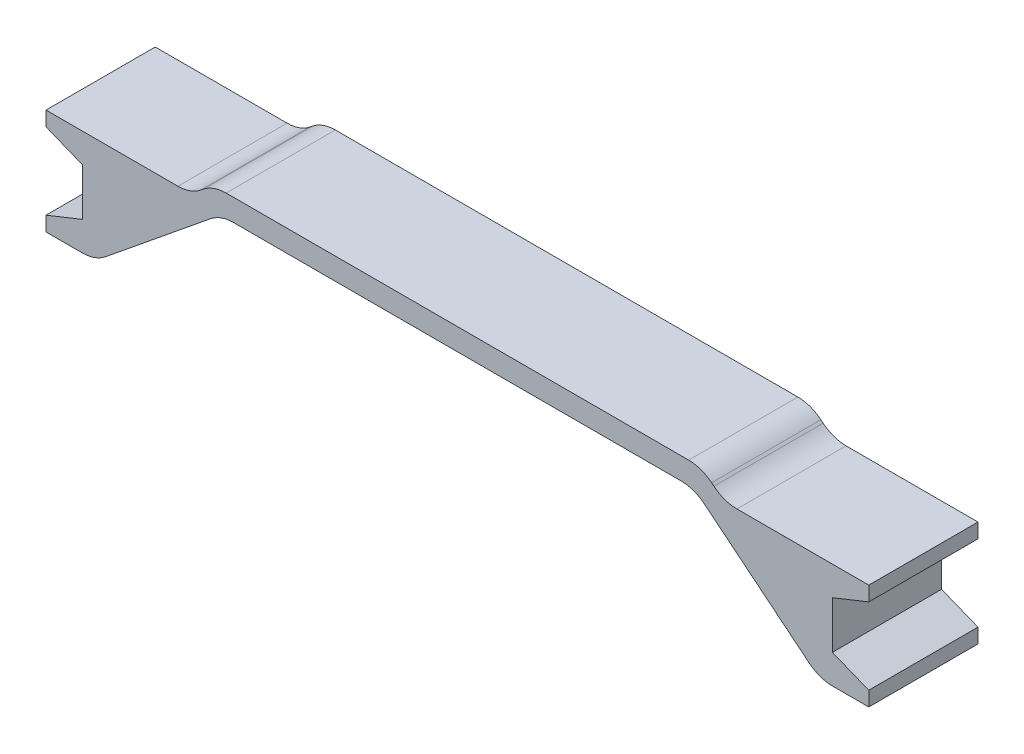
ISO-10303-21;
HEADER;
FILE_DESCRIPTION(('STEP AP214'),'2;1');
FILE_NAME('part.step','',(''),(''),'','','');
FILE_SCHEMA(('AUTOMOTIVE_DESIGN { 1 0 10303 214 1 1 1 1 }'));
ENDSEC;
DATA;
#1=APPLICATION_CONTEXT('core data for automotive mechanical design processes');
#2=APPLICATION_PROTOCOL_DEFINITION('international standard','automotive_design',2000,#1);
#3=PRODUCT_CONTEXT('',#1,'mechanical');
#4=PRODUCT('Part','Part','',(#3));
#5=PRODUCT_RELATED_PRODUCT_CATEGORY('part','',(#4));
#6=PRODUCT_DEFINITION_FORMATION('','',#4);
#7=PRODUCT_DEFINITION_CONTEXT('part definition',#1,'design');
#8=PRODUCT_DEFINITION('design','',#6,#7);
#9=PRODUCT_DEFINITION_SHAPE('','',#8);
#10=(LENGTH_UNIT() NAMED_UNIT(*) SI_UNIT(.MILLI.,.METRE.));
#11=(NAMED_UNIT(*) PLANE_ANGLE_UNIT() SI_UNIT($,.RADIAN.));
#12=(NAMED_UNIT(*) SI_UNIT($,.STERADIAN.) SOLID_ANGLE_UNIT());
#13=UNCERTAINTY_MEASURE_WITH_UNIT(LENGTH_MEASURE(1.E-05),#10,'distance_accuracy_value','');
#14=(GEOMETRIC_REPRESENTATION_CONTEXT(3) GLOBAL_UNCERTAINTY_ASSIGNED_CONTEXT((#13)) GLOBAL_UNIT_ASSIGNED_CONTEXT((#10,
#11,#12)) REPRESENTATION_CONTEXT('',''));
#15=CARTESIAN_POINT('',(0.,0.,0.));
#16=DIRECTION('',(0.,0.,1.));
#17=DIRECTION('',(1.,0.,0.));
#18=AXIS2_PLACEMENT_3D('',#15,#16,#17);
#19=CARTESIAN_POINT('',(30.7395966919539,-8.00000000000001,15.));
#20=DIRECTION('',(0.,0.,-1.));
#21=DIRECTION('',(-1.,0.,0.));
#22=AXIS2_PLACEMENT_3D('',#19,#20,#21);
#23=CYLINDRICAL_SURFACE('',#22,5.);
#24=CARTESIAN_POINT('',(30.7395966919539,-8.00000000000001,0.));
#25=DIRECTION('',(0.,0.,-1.));
#26=DIRECTION('',(-1.,0.,0.));
#27=AXIS2_PLACEMENT_3D('',#24,#25,#26);
#28=CIRCLE('',#27,5.);
#29=CARTESIAN_POINT('',(30.7395966919539,-3.00000000000001,0.));
#30=VERTEX_POINT('',#29);
#31=CARTESIAN_POINT('',(33.8952872823753,-4.12164765686173,0.));
#32=VERTEX_POINT('',#31);
#33=EDGE_CURVE('E257',#30,#32,#28,.T.);
#34=ORIENTED_EDGE('',*,*,#33,.T.);
#35=DIRECTION('',(0.,0.,-1.));
#36=VECTOR('',#35,1.);
#37=CARTESIAN_POINT('',(33.8952872823753,-4.12164765686173,15.));
#38=LINE('',#37,#36);
#39=CARTESIAN_POINT('',(33.8952872823753,-4.12164765686173,15.));
#40=VERTEX_POINT('',#39);
#41=EDGE_CURVE('E11',#40,#32,#38,.T.);
#42=ORIENTED_EDGE('',*,*,#41,.F.);
#43=CARTESIAN_POINT('',(30.7395966919539,-8.00000000000001,15.));
#44=DIRECTION('',(0.,0.,-1.));
#45=DIRECTION('',(-1.,0.,0.));
#46=AXIS2_PLACEMENT_3D('',#43,#44,#45);
#47=CIRCLE('',#46,5.);
#48=CARTESIAN_POINT('',(30.7395966919539,-3.00000000000001,15.));
#49=VERTEX_POINT('',#48);
#50=EDGE_CURVE('E311',#49,#40,#47,.T.);
#51=ORIENTED_EDGE('',*,*,#50,.F.);
#52=DIRECTION('',(0.,0.,-1.));
#53=VECTOR('',#52,1.);
#54=CARTESIAN_POINT('',(30.7395966919539,-3.00000000000001,15.));
#55=LINE('',#54,#53);
#56=EDGE_CURVE('E253',#49,#30,#55,.T.);
#57=ORIENTED_EDGE('',*,*,#56,.T.);
#58=EDGE_LOOP('',(#34,#42,#51,#57));
#59=FACE_BOUND('',#58,.T.);
#60=ADVANCED_FACE('F41',(#59),#23,.F.);
#61=CARTESIAN_POINT('',(33.8952872823753,-4.12164765686173,15.));
#62=DIRECTION('',(0.631138118084268,0.775670468627656,0.));
#63=DIRECTION('',(-0.775670468627656,0.631138118084268,0.));
#64=AXIS2_PLACEMENT_3D('',#61,#62,#63);
#65=PLANE('',#64);
#66=DIRECTION('',(0.775670468627656,-0.631138118084268,0.));
#67=VECTOR('',#66,1.);
#68=CARTESIAN_POINT('',(33.8952872823753,-4.12164765686173,0.));
#69=LINE('',#68,#67);
#70=CARTESIAN_POINT('',(48.3443094095786,-15.8783523431383,0.));
#71=VERTEX_POINT('',#70);
#72=EDGE_CURVE('E260',#32,#71,#69,.T.);
#73=ORIENTED_EDGE('',*,*,#72,.T.);
#74=DIRECTION('',(0.,0.,-1.));
#75=VECTOR('',#74,1.);
#76=CARTESIAN_POINT('',(48.3443094095786,-15.8783523431383,15.));
#77=LINE('',#76,#75);
#78=CARTESIAN_POINT('',(48.3443094095786,-15.8783523431383,15.));
#79=VERTEX_POINT('',#78);
#80=EDGE_CURVE('E49',#79,#71,#77,.T.);
#81=ORIENTED_EDGE('',*,*,#80,.F.);
#82=DIRECTION('',(0.775670468627656,-0.631138118084268,0.));
#83=VECTOR('',#82,1.);
#84=CARTESIAN_POINT('',(33.8952872823753,-4.12164765686173,15.));
#85=LINE('',#84,#83);
#86=EDGE_CURVE('E160',#40,#79,#85,.T.);
#87=ORIENTED_EDGE('',*,*,#86,.F.);
#88=ORIENTED_EDGE('',*,*,#41,.T.);
#89=EDGE_LOOP('',(#73,#81,#87,#88));
#90=FACE_BOUND('',#89,.T.);
#91=ADVANCED_FACE('F469',(#90),#65,.F.);
#92=CARTESIAN_POINT('',(51.5,-12.,15.));
#93=DIRECTION('',(0.,0.,-1.));
#94=DIRECTION('',(-1.,0.,0.));
#95=AXIS2_PLACEMENT_3D('',#92,#93,#94);
#96=CYLINDRICAL_SURFACE('',#95,5.);
#97=CARTESIAN_POINT('',(51.5,-12.,0.));
#98=DIRECTION('',(0.,0.,1.));
#99=DIRECTION('',(1.,0.,0.));
#100=AXIS2_PLACEMENT_3D('',#97,#98,#99);
#101=CIRCLE('',#100,5.);
#102=CARTESIAN_POINT('',(51.5,-17.,0.));
#103=VERTEX_POINT('',#102);
#104=EDGE_CURVE('E262',#71,#103,#101,.T.);
#105=ORIENTED_EDGE('',*,*,#104,.T.);
#106=DIRECTION('',(0.,0.,-1.));
#107=VECTOR('',#106,1.);
#108=CARTESIAN_POINT('',(51.5,-17.,15.));
#109=LINE('',#108,#107);
#110=CARTESIAN_POINT('',(51.5,-17.,15.));
#111=VERTEX_POINT('',#110);
#112=EDGE_CURVE('E378',#111,#103,#109,.T.);
#113=ORIENTED_EDGE('',*,*,#112,.F.);
#114=CARTESIAN_POINT('',(51.5,-12.,15.));
#115=DIRECTION('',(0.,0.,1.));
#116=DIRECTION('',(1.,0.,0.));
#117=AXIS2_PLACEMENT_3D('',#114,#115,#116);
#118=CIRCLE('',#117,5.);
#119=EDGE_CURVE('E386',#79,#111,#118,.T.);
#120=ORIENTED_EDGE('',*,*,#119,.F.);
#121=ORIENTED_EDGE('',*,*,#80,.T.);
#122=EDGE_LOOP('',(#105,#113,#120,#121));
#123=FACE_BOUND('',#122,.T.);
#124=ADVANCED_FACE('F384',(#123),#96,.T.);
#125=CARTESIAN_POINT('',(51.5,-17.,15.));
#126=DIRECTION('',(0.,1.,0.));
#127=DIRECTION('',(0.,0.,1.));
#128=AXIS2_PLACEMENT_3D('',#125,#126,#127);
#129=PLANE('',#128);
#130=DIRECTION('',(1.,0.,0.));
#131=VECTOR('',#130,1.);
#132=CARTESIAN_POINT('',(51.5,-17.,0.));
#133=LINE('',#132,#131);
#134=CARTESIAN_POINT('',(56.5,-17.,0.));
#135=VERTEX_POINT('',#134);
#136=EDGE_CURVE('E264',#103,#135,#133,.T.);
#137=ORIENTED_EDGE('',*,*,#136,.T.);
#138=DIRECTION('',(0.,0.,-1.));
#139=VECTOR('',#138,1.);
#140=CARTESIAN_POINT('',(56.5,-17.,15.));
#141=LINE('',#140,#139);
#142=CARTESIAN_POINT('',(56.5,-17.,15.));
#143=VERTEX_POINT('',#142);
#144=EDGE_CURVE('E375',#143,#135,#141,.T.);
#145=ORIENTED_EDGE('',*,*,#144,.F.);
#146=DIRECTION('',(1.,0.,0.));
#147=VECTOR('',#146,1.);
#148=CARTESIAN_POINT('',(51.5,-17.,15.));
#149=LINE('',#148,#147);
#150=EDGE_CURVE('E404',#111,#143,#149,.T.);
#151=ORIENTED_EDGE('',*,*,#150,.F.);
#152=ORIENTED_EDGE('',*,*,#112,.T.);
#153=EDGE_LOOP('',(#137,#145,#151,#152));
#154=FACE_BOUND('',#153,.T.);
#155=ADVANCED_FACE('F395',(#154),#129,.F.);
#156=CARTESIAN_POINT('',(56.5,-17.,15.));
#157=DIRECTION('',(-1.,0.,0.));
#158=DIRECTION('',(0.,-1.,0.));
#159=AXIS2_PLACEMENT_3D('',#156,#157,#158);
#160=PLANE('',#159);
#161=DIRECTION('',(0.,1.,0.));
#162=VECTOR('',#161,1.);
#163=CARTESIAN_POINT('',(56.5,-17.,0.));
#164=LINE('',#163,#162);
#165=CARTESIAN_POINT('',(56.5,-15.,0.));
#166=VERTEX_POINT('',#165);
#167=EDGE_CURVE('E266',#135,#166,#164,.T.);
#168=ORIENTED_EDGE('',*,*,#167,.T.);
#169=DIRECTION('',(0.,0.,-1.));
#170=VECTOR('',#169,1.);
#171=CARTESIAN_POINT('',(56.5,-15.,15.));
#172=LINE('',#171,#170);
#173=CARTESIAN_POINT('',(56.5,-15.,15.));
#174=VERTEX_POINT('',#173);
#175=EDGE_CURVE('E372',#174,#166,#172,.T.);
#176=ORIENTED_EDGE('',*,*,#175,.F.);
#177=DIRECTION('',(0.,1.,0.));
#178=VECTOR('',#177,1.);
#179=CARTESIAN_POINT('',(56.5,-17.,15.));
#180=LINE('',#179,#178);
#181=EDGE_CURVE('E401',#143,#174,#180,.T.);
#182=ORIENTED_EDGE('',*,*,#181,.F.);
#183=ORIENTED_EDGE('',*,*,#144,.T.);
#184=EDGE_LOOP('',(#168,#176,#182,#183));
#185=FACE_BOUND('',#184,.T.);
#186=ADVANCED_FACE('F399',(#185),#160,.F.);
#187=CARTESIAN_POINT('',(56.5,-15.,15.));
#188=DIRECTION('',(-0.371390676354104,-0.928476690885259,0.));
#189=DIRECTION('',(0.928476690885259,-0.371390676354104,0.));
#190=AXIS2_PLACEMENT_3D('',#187,#188,#189);
#191=PLANE('',#190);
#192=DIRECTION('',(-0.928476690885259,0.371390676354104,0.));
#193=VECTOR('',#192,1.);
#194=CARTESIAN_POINT('',(56.5,-15.,0.));
#195=LINE('',#194,#193);
#196=CARTESIAN_POINT('',(51.5,-13.,0.));
#197=VERTEX_POINT('',#196);
#198=EDGE_CURVE('E268',#166,#197,#195,.T.);
#199=ORIENTED_EDGE('',*,*,#198,.T.);
#200=DIRECTION('',(0.,0.,-1.));
#201=VECTOR('',#200,1.);
#202=CARTESIAN_POINT('',(51.5,-13.,15.));
#203=LINE('',#202,#201);
#204=CARTESIAN_POINT('',(51.5,-13.,15.));
#205=VERTEX_POINT('',#204);
#206=EDGE_CURVE('E369',#205,#197,#203,.T.);
#207=ORIENTED_EDGE('',*,*,#206,.F.);
#208=DIRECTION('',(-0.928476690885259,0.371390676354104,0.));
#209=VECTOR('',#208,1.);
#210=CARTESIAN_POINT('',(56.5,-15.,15.));
#211=LINE('',#210,#209);
#212=EDGE_CURVE('E403',#174,#205,#211,.T.);
#213=ORIENTED_EDGE('',*,*,#212,.F.);
#214=ORIENTED_EDGE('',*,*,#175,.T.);
#215=EDGE_LOOP('',(#199,#207,#213,#214));
#216=FACE_BOUND('',#215,.T.);
#217=ADVANCED_FACE('F482',(#216),#191,.F.);
#218=CARTESIAN_POINT('',(51.5,-13.,15.));
#219=DIRECTION('',(-1.,0.,0.));
#220=DIRECTION('',(0.,-1.,0.));
#221=AXIS2_PLACEMENT_3D('',#218,#219,#220);
#222=PLANE('',#221);
#223=DIRECTION('',(0.,1.,0.));
#224=VECTOR('',#223,1.);
#225=CARTESIAN_POINT('',(51.5,-13.,0.));
#226=LINE('',#225,#224);
#227=CARTESIAN_POINT('',(51.5,-6.49999999999999,0.));
#228=VERTEX_POINT('',#227);
#229=EDGE_CURVE('E270',#197,#228,#226,.T.);
#230=ORIENTED_EDGE('',*,*,#229,.T.);
#231=DIRECTION('',(0.,0.,-1.));
#232=VECTOR('',#231,1.);
#233=CARTESIAN_POINT('',(51.5,-6.49999999999999,15.));
#234=LINE('',#233,#232);
#235=CARTESIAN_POINT('',(51.5,-6.49999999999999,15.));
#236=VERTEX_POINT('',#235);
#237=EDGE_CURVE('E366',#236,#228,#234,.T.);
#238=ORIENTED_EDGE('',*,*,#237,.F.);
#239=DIRECTION('',(0.,1.,0.));
#240=VECTOR('',#239,1.);
#241=CARTESIAN_POINT('',(51.5,-13.,15.));
#242=LINE('',#241,#240);
#243=EDGE_CURVE('E406',#205,#236,#242,.T.);
#244=ORIENTED_EDGE('',*,*,#243,.F.);
#245=ORIENTED_EDGE('',*,*,#206,.T.);
#246=EDGE_LOOP('',(#230,#238,#244,#245));
#247=FACE_BOUND('',#246,.T.);
#248=ADVANCED_FACE('F485',(#247),#222,.F.);
#249=CARTESIAN_POINT('',(51.5,-6.49999999999999,15.));
#250=DIRECTION('',(-0.371390676354104,0.928476690885259,0.));
#251=DIRECTION('',(-0.928476690885259,-0.371390676354104,0.));
#252=AXIS2_PLACEMENT_3D('',#249,#250,#251);
#253=PLANE('',#252);
#254=DIRECTION('',(0.928476690885259,0.371390676354104,0.));
#255=VECTOR('',#254,1.);
#256=CARTESIAN_POINT('',(51.5,-6.49999999999999,0.));
#257=LINE('',#256,#255);
#258=CARTESIAN_POINT('',(56.5,-4.49999999999999,0.));
#259=VERTEX_POINT('',#258);
#260=EDGE_CURVE('E272',#228,#259,#257,.T.);
#261=ORIENTED_EDGE('',*,*,#260,.T.);
#262=DIRECTION('',(0.,0.,-1.));
#263=VECTOR('',#262,1.);
#264=CARTESIAN_POINT('',(56.5,-4.49999999999999,15.));
#265=LINE('',#264,#263);
#266=CARTESIAN_POINT('',(56.5,-4.49999999999999,15.));
#267=VERTEX_POINT('',#266);
#268=EDGE_CURVE('E363',#267,#259,#265,.T.);
#269=ORIENTED_EDGE('',*,*,#268,.F.);
#270=DIRECTION('',(0.928476690885259,0.371390676354104,0.));
#271=VECTOR('',#270,1.);
#272=CARTESIAN_POINT('',(51.5,-6.49999999999999,15.));
#273=LINE('',#272,#271);
#274=EDGE_CURVE('E412',#236,#267,#273,.T.);
#275=ORIENTED_EDGE('',*,*,#274,.F.);
#276=ORIENTED_EDGE('',*,*,#237,.T.);
#277=EDGE_LOOP('',(#261,#269,#275,#276));
#278=FACE_BOUND('',#277,.T.);
#279=ADVANCED_FACE('F489',(#278),#253,.F.);
#280=CARTESIAN_POINT('',(56.5,-4.49999999999999,15.));
#281=DIRECTION('',(-1.,0.,0.));
#282=DIRECTION('',(0.,0.,1.));
#283=AXIS2_PLACEMENT_3D('',#280,#281,#282);
#284=PLANE('',#283);
#285=DIRECTION('',(0.,1.,0.));
#286=VECTOR('',#285,1.);
#287=CARTESIAN_POINT('',(56.5,-4.49999999999999,0.));
#288=LINE('',#287,#286);
#289=CARTESIAN_POINT('',(56.5,-2.49999999999999,0.));
#290=VERTEX_POINT('',#289);
#291=EDGE_CURVE('E274',#259,#290,#288,.T.);
#292=ORIENTED_EDGE('',*,*,#291,.T.);
#293=DIRECTION('',(0.,0.,-1.));
#294=VECTOR('',#293,1.);
#295=CARTESIAN_POINT('',(56.5,-2.49999999999999,15.));
#296=LINE('',#295,#294);
#297=CARTESIAN_POINT('',(56.5,-2.49999999999999,15.));
#298=VERTEX_POINT('',#297);
#299=EDGE_CURVE('E360',#298,#290,#296,.T.);
#300=ORIENTED_EDGE('',*,*,#299,.F.);
#301=DIRECTION('',(0.,1.,0.));
#302=VECTOR('',#301,1.);
#303=CARTESIAN_POINT('',(56.5,-4.49999999999999,15.));
#304=LINE('',#303,#302);
#305=EDGE_CURVE('E414',#267,#298,#304,.T.);
#306=ORIENTED_EDGE('',*,*,#305,.F.);
#307=ORIENTED_EDGE('',*,*,#268,.T.);
#308=EDGE_LOOP('',(#292,#300,#306,#307));
#309=FACE_BOUND('',#308,.T.);
#310=ADVANCED_FACE('F493',(#309),#284,.F.);
#311=CARTESIAN_POINT('',(56.5,-2.49999999999999,15.));
#312=DIRECTION('',(0.,-1.,0.));
#313=DIRECTION('',(0.,0.,-1.));
#314=AXIS2_PLACEMENT_3D('',#311,#312,#313);
#315=PLANE('',#314);
#316=DIRECTION('',(-1.,0.,0.));
#317=VECTOR('',#316,1.);
#318=CARTESIAN_POINT('',(56.5,-2.49999999999999,0.));
#319=LINE('',#318,#317);
#320=CARTESIAN_POINT('',(38.3879122825509,-2.49999999999999,0.));
#321=VERTEX_POINT('',#320);
#322=EDGE_CURVE('E276',#290,#321,#319,.T.);
#323=ORIENTED_EDGE('',*,*,#322,.T.);
#324=DIRECTION('',(0.,0.,-1.));
#325=VECTOR('',#324,1.);
#326=CARTESIAN_POINT('',(38.3879122825509,-2.49999999999999,15.));
#327=LINE('',#326,#325);
#328=CARTESIAN_POINT('',(38.3879122825509,-2.49999999999999,15.));
#329=VERTEX_POINT('',#328);
#330=EDGE_CURVE('E357',#329,#321,#327,.T.);
#331=ORIENTED_EDGE('',*,*,#330,.F.);
#332=DIRECTION('',(-1.,0.,0.));
#333=VECTOR('',#332,1.);
#334=CARTESIAN_POINT('',(56.5,-2.49999999999999,15.));
#335=LINE('',#334,#333);
#336=EDGE_CURVE('E416',#298,#329,#335,.T.);
#337=ORIENTED_EDGE('',*,*,#336,.F.);
#338=ORIENTED_EDGE('',*,*,#299,.T.);
#339=EDGE_LOOP('',(#323,#331,#337,#338));
#340=FACE_BOUND('',#339,.T.);
#341=ADVANCED_FACE('F497',(#340),#315,.F.);
#342=CARTESIAN_POINT('',(38.3879122825509,2.50000000000001,15.));
#343=DIRECTION('',(0.,0.,-1.));
#344=DIRECTION('',(-1.,0.,0.));
#345=AXIS2_PLACEMENT_3D('',#342,#343,#344);
#346=CYLINDRICAL_SURFACE('',#345,5.);
#347=CARTESIAN_POINT('',(38.3879122825509,2.50000000000001,0.));
#348=DIRECTION('',(0.,0.,-1.));
#349=DIRECTION('',(-1.,0.,0.));
#350=AXIS2_PLACEMENT_3D('',#347,#348,#349);
#351=CIRCLE('',#350,5.);
#352=CARTESIAN_POINT('',(35.2322216921296,-1.37835234313827,0.));
#353=VERTEX_POINT('',#352);
#354=EDGE_CURVE('E278',#321,#353,#351,.T.);
#355=ORIENTED_EDGE('',*,*,#354,.T.);
#356=DIRECTION('',(0.,0.,-1.));
#357=VECTOR('',#356,1.);
#358=CARTESIAN_POINT('',(35.2322216921296,-1.37835234313827,15.));
#359=LINE('',#358,#357);
#360=CARTESIAN_POINT('',(35.2322216921296,-1.37835234313827,15.));
#361=VERTEX_POINT('',#360);
#362=EDGE_CURVE('E354',#361,#353,#359,.T.);
#363=ORIENTED_EDGE('',*,*,#362,.F.);
#364=CARTESIAN_POINT('',(38.3879122825509,2.50000000000001,15.));
#365=DIRECTION('',(0.,0.,-1.));
#366=DIRECTION('',(-1.,0.,0.));
#367=AXIS2_PLACEMENT_3D('',#364,#365,#366);
#368=CIRCLE('',#367,5.);
#369=EDGE_CURVE('E418',#329,#361,#368,.T.);
#370=ORIENTED_EDGE('',*,*,#369,.F.);
#371=ORIENTED_EDGE('',*,*,#330,.T.);
#372=EDGE_LOOP('',(#355,#363,#370,#371));
#373=FACE_BOUND('',#372,.T.);
#374=ADVANCED_FACE('F501',(#373),#346,.F.);
#375=CARTESIAN_POINT('',(35.2322216921296,-1.37835234313827,15.));
#376=DIRECTION('',(-0.631138118084278,-0.775670468627649,0.));
#377=DIRECTION('',(0.775670468627649,-0.631138118084278,0.));
#378=AXIS2_PLACEMENT_3D('',#375,#376,#377);
#379=PLANE('',#378);
#380=DIRECTION('',(-0.775670468627649,0.631138118084278,0.));
#381=VECTOR('',#380,1.);
#382=CARTESIAN_POINT('',(35.2322216921296,-1.37835234313827,0.));
#383=LINE('',#382,#381);
#384=CARTESIAN_POINT('',(34.916730932504,-1.12164765686172,0.));
#385=VERTEX_POINT('',#384);
#386=EDGE_CURVE('E280',#353,#385,#383,.T.);
#387=ORIENTED_EDGE('',*,*,#386,.T.);
#388=DIRECTION('',(0.,0.,-1.));
#389=VECTOR('',#388,1.);
#390=CARTESIAN_POINT('',(34.916730932504,-1.12164765686172,15.));
#391=LINE('',#390,#389);
#392=CARTESIAN_POINT('',(34.916730932504,-1.12164765686172,15.));
#393=VERTEX_POINT('',#392);
#394=EDGE_CURVE('E351',#393,#385,#391,.T.);
#395=ORIENTED_EDGE('',*,*,#394,.F.);
#396=DIRECTION('',(-0.775670468627649,0.631138118084278,0.));
#397=VECTOR('',#396,1.);
#398=CARTESIAN_POINT('',(35.2322216921296,-1.37835234313827,15.));
#399=LINE('',#398,#397);
#400=EDGE_CURVE('E420',#361,#393,#399,.T.);
#401=ORIENTED_EDGE('',*,*,#400,.F.);
#402=ORIENTED_EDGE('',*,*,#362,.T.);
#403=EDGE_LOOP('',(#387,#395,#401,#402));
#404=FACE_BOUND('',#403,.T.);
#405=ADVANCED_FACE('F505',(#404),#379,.F.);
#406=CARTESIAN_POINT('',(31.7610403420827,-5.,15.));
#407=DIRECTION('',(0.,0.,-1.));
#408=DIRECTION('',(-1.,0.,0.));
#409=AXIS2_PLACEMENT_3D('',#406,#407,#408);
#410=CYLINDRICAL_SURFACE('',#409,5.);
#411=CARTESIAN_POINT('',(31.7610403420827,-5.,0.));
#412=DIRECTION('',(0.,0.,1.));
#413=DIRECTION('',(1.,0.,0.));
#414=AXIS2_PLACEMENT_3D('',#411,#412,#413);
#415=CIRCLE('',#414,5.);
#416=CARTESIAN_POINT('',(31.7610403420827,0.,0.));
#417=VERTEX_POINT('',#416);
#418=EDGE_CURVE('E282',#385,#417,#415,.T.);
#419=ORIENTED_EDGE('',*,*,#418,.T.);
#420=DIRECTION('',(0.,0.,-1.));
#421=VECTOR('',#420,1.);
#422=CARTESIAN_POINT('',(31.7610403420827,0.,15.));
#423=LINE('',#422,#421);
#424=CARTESIAN_POINT('',(31.7610403420827,0.,15.));
#425=VERTEX_POINT('',#424);
#426=EDGE_CURVE('E348',#425,#417,#423,.T.);
#427=ORIENTED_EDGE('',*,*,#426,.F.);
#428=CARTESIAN_POINT('',(31.7610403420827,-5.,15.));
#429=DIRECTION('',(0.,0.,1.));
#430=DIRECTION('',(1.,0.,0.));
#431=AXIS2_PLACEMENT_3D('',#428,#429,#430);
#432=CIRCLE('',#431,5.);
#433=EDGE_CURVE('E422',#393,#425,#432,.T.);
#434=ORIENTED_EDGE('',*,*,#433,.F.);
#435=ORIENTED_EDGE('',*,*,#394,.T.);
#436=EDGE_LOOP('',(#419,#427,#434,#435));
#437=FACE_BOUND('',#436,.T.);
#438=ADVANCED_FACE('F509',(#437),#410,.T.);
#439=CARTESIAN_POINT('',(-31.7610403420827,0.,15.));
#440=DIRECTION('',(0.,-1.,0.));
#441=DIRECTION('',(0.,0.,-1.));
#442=AXIS2_PLACEMENT_3D('',#439,#440,#441);
#443=PLANE('',#442);
#444=DIRECTION('',(-1.,0.,0.));
#445=VECTOR('',#444,1.);
#446=CARTESIAN_POINT('',(-31.7610403420827,0.,0.));
#447=LINE('',#446,#445);
#448=CARTESIAN_POINT('',(-31.7610403420827,0.,0.));
#449=VERTEX_POINT('',#448);
#450=EDGE_CURVE('E284',#417,#449,#447,.T.);
#451=ORIENTED_EDGE('',*,*,#450,.T.);
#452=DIRECTION('',(0.,0.,-1.));
#453=VECTOR('',#452,1.);
#454=CARTESIAN_POINT('',(-31.7610403420827,0.,15.));
#455=LINE('',#454,#453);
#456=CARTESIAN_POINT('',(-31.7610403420827,0.,15.));
#457=VERTEX_POINT('',#456);
#458=EDGE_CURVE('E345',#457,#449,#455,.T.);
#459=ORIENTED_EDGE('',*,*,#458,.F.);
#460=DIRECTION('',(-1.,0.,0.));
#461=VECTOR('',#460,1.);
#462=CARTESIAN_POINT('',(-31.7610403420827,0.,15.));
#463=LINE('',#462,#461);
#464=EDGE_CURVE('E424',#425,#457,#463,.T.);
#465=ORIENTED_EDGE('',*,*,#464,.F.);
#466=ORIENTED_EDGE('',*,*,#426,.T.);
#467=EDGE_LOOP('',(#451,#459,#465,#466));
#468=FACE_BOUND('',#467,.T.);
#469=ADVANCED_FACE('F513',(#468),#443,.F.);
#470=CARTESIAN_POINT('',(-31.7610403420827,-5.,15.));
#471=DIRECTION('',(0.,0.,-1.));
#472=DIRECTION('',(-1.,0.,0.));
#473=AXIS2_PLACEMENT_3D('',#470,#471,#472);
#474=CYLINDRICAL_SURFACE('',#473,5.);
#475=CARTESIAN_POINT('',(-31.7610403420827,-5.,0.));
#476=DIRECTION('',(0.,0.,1.));
#477=DIRECTION('',(-1.,0.,0.));
#478=AXIS2_PLACEMENT_3D('',#475,#476,#477);
#479=CIRCLE('',#478,5.);
#480=CARTESIAN_POINT('',(-34.916730932504,-1.12164765686172,0.));
#481=VERTEX_POINT('',#480);
#482=EDGE_CURVE('E286',#449,#481,#479,.T.);
#483=ORIENTED_EDGE('',*,*,#482,.T.);
#484=DIRECTION('',(0.,0.,-1.));
#485=VECTOR('',#484,1.);
#486=CARTESIAN_POINT('',(-34.916730932504,-1.12164765686172,15.));
#487=LINE('',#486,#485);
#488=CARTESIAN_POINT('',(-34.916730932504,-1.12164765686172,15.));
#489=VERTEX_POINT('',#488);
#490=EDGE_CURVE('E342',#489,#481,#487,.T.);
#491=ORIENTED_EDGE('',*,*,#490,.F.);
#492=CARTESIAN_POINT('',(-31.7610403420827,-5.,15.));
#493=DIRECTION('',(0.,0.,1.));
#494=DIRECTION('',(-1.,0.,0.));
#495=AXIS2_PLACEMENT_3D('',#492,#493,#494);
#496=CIRCLE('',#495,5.);
#497=EDGE_CURVE('E426',#457,#489,#496,.T.);
#498=ORIENTED_EDGE('',*,*,#497,.F.);
#499=ORIENTED_EDGE('',*,*,#458,.T.);
#500=EDGE_LOOP('',(#483,#491,#498,#499));
#501=FACE_BOUND('',#500,.T.);
#502=ADVANCED_FACE('F517',(#501),#474,.T.);
#503=CARTESIAN_POINT('',(-35.2322216921296,-1.37835234313827,15.));
#504=DIRECTION('',(0.631138118084278,-0.775670468627649,0.));
#505=DIRECTION('',(0.775670468627649,0.631138118084278,0.));
#506=AXIS2_PLACEMENT_3D('',#503,#504,#505);
#507=PLANE('',#506);
#508=DIRECTION('',(-0.775670468627649,-0.631138118084278,0.));
#509=VECTOR('',#508,1.);
#510=CARTESIAN_POINT('',(-35.2322216921296,-1.37835234313827,0.));
#511=LINE('',#510,#509);
#512=CARTESIAN_POINT('',(-35.2322216921296,-1.37835234313827,0.));
#513=VERTEX_POINT('',#512);
#514=EDGE_CURVE('E288',#481,#513,#511,.T.);
#515=ORIENTED_EDGE('',*,*,#514,.T.);
#516=DIRECTION('',(0.,0.,-1.));
#517=VECTOR('',#516,1.);
#518=CARTESIAN_POINT('',(-35.2322216921296,-1.37835234313827,15.));
#519=LINE('',#518,#517);
#520=CARTESIAN_POINT('',(-35.2322216921296,-1.37835234313827,15.));
#521=VERTEX_POINT('',#520);
#522=EDGE_CURVE('E339',#521,#513,#519,.T.);
#523=ORIENTED_EDGE('',*,*,#522,.F.);
#524=DIRECTION('',(-0.775670468627649,-0.631138118084278,0.));
#525=VECTOR('',#524,1.);
#526=CARTESIAN_POINT('',(-35.2322216921296,-1.37835234313827,15.));
#527=LINE('',#526,#525);
#528=EDGE_CURVE('E428',#489,#521,#527,.T.);
#529=ORIENTED_EDGE('',*,*,#528,.F.);
#530=ORIENTED_EDGE('',*,*,#490,.T.);
#531=EDGE_LOOP('',(#515,#523,#529,#530));
#532=FACE_BOUND('',#531,.T.);
#533=ADVANCED_FACE('F521',(#532),#507,.F.);
#534=CARTESIAN_POINT('',(-38.3879122825509,2.50000000000001,15.));
#535=DIRECTION('',(0.,0.,-1.));
#536=DIRECTION('',(-1.,0.,0.));
#537=AXIS2_PLACEMENT_3D('',#534,#535,#536);
#538=CYLINDRICAL_SURFACE('',#537,5.);
#539=CARTESIAN_POINT('',(-38.3879122825509,2.50000000000001,0.));
#540=DIRECTION('',(0.,0.,-1.));
#541=DIRECTION('',(1.,0.,0.));
#542=AXIS2_PLACEMENT_3D('',#539,#540,#541);
#543=CIRCLE('',#542,5.);
#544=CARTESIAN_POINT('',(-38.3879122825509,-2.49999999999999,0.));
#545=VERTEX_POINT('',#544);
#546=EDGE_CURVE('E290',#513,#545,#543,.T.);
#547=ORIENTED_EDGE('',*,*,#546,.T.);
#548=DIRECTION('',(0.,0.,-1.));
#549=VECTOR('',#548,1.);
#550=CARTESIAN_POINT('',(-38.3879122825509,-2.49999999999999,15.));
#551=LINE('',#550,#549);
#552=CARTESIAN_POINT('',(-38.3879122825509,-2.49999999999999,15.));
#553=VERTEX_POINT('',#552);
#554=EDGE_CURVE('E336',#553,#545,#551,.T.);
#555=ORIENTED_EDGE('',*,*,#554,.F.);
#556=CARTESIAN_POINT('',(-38.3879122825509,2.50000000000001,15.));
#557=DIRECTION('',(0.,0.,-1.));
#558=DIRECTION('',(1.,0.,0.));
#559=AXIS2_PLACEMENT_3D('',#556,#557,#558);
#560=CIRCLE('',#559,5.);
#561=EDGE_CURVE('E430',#521,#553,#560,.T.);
#562=ORIENTED_EDGE('',*,*,#561,.F.);
#563=ORIENTED_EDGE('',*,*,#522,.T.);
#564=EDGE_LOOP('',(#547,#555,#562,#563));
#565=FACE_BOUND('',#564,.T.);
#566=ADVANCED_FACE('F525',(#565),#538,.F.);
#567=CARTESIAN_POINT('',(-56.5,-2.49999999999999,15.));
#568=DIRECTION('',(0.,-1.,0.));
#569=DIRECTION('',(0.,0.,-1.));
#570=AXIS2_PLACEMENT_3D('',#567,#568,#569);
#571=PLANE('',#570);
#572=DIRECTION('',(-1.,0.,0.));
#573=VECTOR('',#572,1.);
#574=CARTESIAN_POINT('',(-56.5,-2.49999999999999,0.));
#575=LINE('',#574,#573);
#576=CARTESIAN_POINT('',(-56.5,-2.49999999999999,0.));
#577=VERTEX_POINT('',#576);
#578=EDGE_CURVE('E292',#545,#577,#575,.T.);
#579=ORIENTED_EDGE('',*,*,#578,.T.);
#580=DIRECTION('',(0.,0.,-1.));
#581=VECTOR('',#580,1.);
#582=CARTESIAN_POINT('',(-56.5,-2.49999999999999,15.));
#583=LINE('',#582,#581);
#584=CARTESIAN_POINT('',(-56.5,-2.49999999999999,15.));
#585=VERTEX_POINT('',#584);
#586=EDGE_CURVE('E333',#585,#577,#583,.T.);
#587=ORIENTED_EDGE('',*,*,#586,.F.);
#588=DIRECTION('',(-1.,0.,0.));
#589=VECTOR('',#588,1.);
#590=CARTESIAN_POINT('',(-56.5,-2.49999999999999,15.));
#591=LINE('',#590,#589);
#592=EDGE_CURVE('E432',#553,#585,#591,.T.);
#593=ORIENTED_EDGE('',*,*,#592,.F.);
#594=ORIENTED_EDGE('',*,*,#554,.T.);
#595=EDGE_LOOP('',(#579,#587,#593,#594));
#596=FACE_BOUND('',#595,.T.);
#597=ADVANCED_FACE('F529',(#596),#571,.F.);
#598=CARTESIAN_POINT('',(-56.5,-4.49999999999999,15.));
#599=DIRECTION('',(1.,0.,0.));
#600=DIRECTION('',(0.,0.,-1.));
#601=AXIS2_PLACEMENT_3D('',#598,#599,#600);
#602=PLANE('',#601);
#603=DIRECTION('',(0.,-1.,0.));
#604=VECTOR('',#603,1.);
#605=CARTESIAN_POINT('',(-56.5,-4.49999999999999,0.));
#606=LINE('',#605,#604);
#607=CARTESIAN_POINT('',(-56.5,-4.49999999999999,0.));
#608=VERTEX_POINT('',#607);
#609=EDGE_CURVE('E294',#577,#608,#606,.T.);
#610=ORIENTED_EDGE('',*,*,#609,.T.);
#611=DIRECTION('',(0.,0.,-1.));
#612=VECTOR('',#611,1.);
#613=CARTESIAN_POINT('',(-56.5,-4.49999999999999,15.));
#614=LINE('',#613,#612);
#615=CARTESIAN_POINT('',(-56.5,-4.49999999999999,15.));
#616=VERTEX_POINT('',#615);
#617=EDGE_CURVE('E330',#616,#608,#614,.T.);
#618=ORIENTED_EDGE('',*,*,#617,.F.);
#619=DIRECTION('',(0.,-1.,0.));
#620=VECTOR('',#619,1.);
#621=CARTESIAN_POINT('',(-56.5,-4.49999999999999,15.));
#622=LINE('',#621,#620);
#623=EDGE_CURVE('E434',#585,#616,#622,.T.);
#624=ORIENTED_EDGE('',*,*,#623,.F.);
#625=ORIENTED_EDGE('',*,*,#586,.T.);
#626=EDGE_LOOP('',(#610,#618,#624,#625));
#627=FACE_BOUND('',#626,.T.);
#628=ADVANCED_FACE('F533',(#627),#602,.F.);
#629=CARTESIAN_POINT('',(-51.5,-6.49999999999999,15.));
#630=DIRECTION('',(0.371390676354104,0.928476690885259,0.));
#631=DIRECTION('',(-0.928476690885259,0.371390676354104,0.));
#632=AXIS2_PLACEMENT_3D('',#629,#630,#631);
#633=PLANE('',#632);
#634=DIRECTION('',(0.928476690885259,-0.371390676354104,0.));
#635=VECTOR('',#634,1.);
#636=CARTESIAN_POINT('',(-51.5,-6.49999999999999,0.));
#637=LINE('',#636,#635);
#638=CARTESIAN_POINT('',(-51.5,-6.49999999999999,0.));
#639=VERTEX_POINT('',#638);
#640=EDGE_CURVE('E296',#608,#639,#637,.T.);
#641=ORIENTED_EDGE('',*,*,#640,.T.);
#642=DIRECTION('',(0.,0.,-1.));
#643=VECTOR('',#642,1.);
#644=CARTESIAN_POINT('',(-51.5,-6.49999999999999,15.));
#645=LINE('',#644,#643);
#646=CARTESIAN_POINT('',(-51.5,-6.49999999999999,15.));
#647=VERTEX_POINT('',#646);
#648=EDGE_CURVE('E327',#647,#639,#645,.T.);
#649=ORIENTED_EDGE('',*,*,#648,.F.);
#650=DIRECTION('',(0.928476690885259,-0.371390676354104,0.));
#651=VECTOR('',#650,1.);
#652=CARTESIAN_POINT('',(-51.5,-6.49999999999999,15.));
#653=LINE('',#652,#651);
#654=EDGE_CURVE('E436',#616,#647,#653,.T.);
#655=ORIENTED_EDGE('',*,*,#654,.F.);
#656=ORIENTED_EDGE('',*,*,#617,.T.);
#657=EDGE_LOOP('',(#641,#649,#655,#656));
#658=FACE_BOUND('',#657,.T.);
#659=ADVANCED_FACE('F537',(#658),#633,.F.);
#660=CARTESIAN_POINT('',(-51.5,-13.,15.));
#661=DIRECTION('',(1.,0.,0.));
#662=DIRECTION('',(0.,1.,0.));
#663=AXIS2_PLACEMENT_3D('',#660,#661,#662);
#664=PLANE('',#663);
#665=DIRECTION('',(0.,-1.,0.));
#666=VECTOR('',#665,1.);
#667=CARTESIAN_POINT('',(-51.5,-13.,0.));
#668=LINE('',#667,#666);
#669=CARTESIAN_POINT('',(-51.5,-13.,0.));
#670=VERTEX_POINT('',#669);
#671=EDGE_CURVE('E298',#639,#670,#668,.T.);
#672=ORIENTED_EDGE('',*,*,#671,.T.);
#673=DIRECTION('',(0.,0.,-1.));
#674=VECTOR('',#673,1.);
#675=CARTESIAN_POINT('',(-51.5,-13.,15.));
#676=LINE('',#675,#674);
#677=CARTESIAN_POINT('',(-51.5,-13.,15.));
#678=VERTEX_POINT('',#677);
#679=EDGE_CURVE('E324',#678,#670,#676,.T.);
#680=ORIENTED_EDGE('',*,*,#679,.F.);
#681=DIRECTION('',(0.,-1.,0.));
#682=VECTOR('',#681,1.);
#683=CARTESIAN_POINT('',(-51.5,-13.,15.));
#684=LINE('',#683,#682);
#685=EDGE_CURVE('E438',#647,#678,#684,.T.);
#686=ORIENTED_EDGE('',*,*,#685,.F.);
#687=ORIENTED_EDGE('',*,*,#648,.T.);
#688=EDGE_LOOP('',(#672,#680,#686,#687));
#689=FACE_BOUND('',#688,.T.);
#690=ADVANCED_FACE('F541',(#689),#664,.F.);
#691=CARTESIAN_POINT('',(-56.5,-15.,15.));
#692=DIRECTION('',(0.371390676354104,-0.928476690885259,0.));
#693=DIRECTION('',(0.928476690885259,0.371390676354104,0.));
#694=AXIS2_PLACEMENT_3D('',#691,#692,#693);
#695=PLANE('',#694);
#696=DIRECTION('',(-0.928476690885259,-0.371390676354104,0.));
#697=VECTOR('',#696,1.);
#698=CARTESIAN_POINT('',(-56.5,-15.,0.));
#699=LINE('',#698,#697);
#700=CARTESIAN_POINT('',(-56.5,-15.,0.));
#701=VERTEX_POINT('',#700);
#702=EDGE_CURVE('E300',#670,#701,#699,.T.);
#703=ORIENTED_EDGE('',*,*,#702,.T.);
#704=DIRECTION('',(0.,0.,-1.));
#705=VECTOR('',#704,1.);
#706=CARTESIAN_POINT('',(-56.5,-15.,15.));
#707=LINE('',#706,#705);
#708=CARTESIAN_POINT('',(-56.5,-15.,15.));
#709=VERTEX_POINT('',#708);
#710=EDGE_CURVE('E321',#709,#701,#707,.T.);
#711=ORIENTED_EDGE('',*,*,#710,.F.);
#712=DIRECTION('',(-0.928476690885259,-0.371390676354104,0.));
#713=VECTOR('',#712,1.);
#714=CARTESIAN_POINT('',(-56.5,-15.,15.));
#715=LINE('',#714,#713);
#716=EDGE_CURVE('E440',#678,#709,#715,.T.);
#717=ORIENTED_EDGE('',*,*,#716,.F.);
#718=ORIENTED_EDGE('',*,*,#679,.T.);
#719=EDGE_LOOP('',(#703,#711,#717,#718));
#720=FACE_BOUND('',#719,.T.);
#721=ADVANCED_FACE('F545',(#720),#695,.F.);
#722=CARTESIAN_POINT('',(-56.5,-17.,15.));
#723=DIRECTION('',(1.,0.,0.));
#724=DIRECTION('',(0.,1.,0.));
#725=AXIS2_PLACEMENT_3D('',#722,#723,#724);
#726=PLANE('',#725);
#727=DIRECTION('',(0.,-1.,0.));
#728=VECTOR('',#727,1.);
#729=CARTESIAN_POINT('',(-56.5,-17.,0.));
#730=LINE('',#729,#728);
#731=CARTESIAN_POINT('',(-56.5,-17.,0.));
#732=VERTEX_POINT('',#731);
#733=EDGE_CURVE('E302',#701,#732,#730,.T.);
#734=ORIENTED_EDGE('',*,*,#733,.T.);
#735=DIRECTION('',(0.,0.,-1.));
#736=VECTOR('',#735,1.);
#737=CARTESIAN_POINT('',(-56.5,-17.,15.));
#738=LINE('',#737,#736);
#739=CARTESIAN_POINT('',(-56.5,-17.,15.));
#740=VERTEX_POINT('',#739);
#741=EDGE_CURVE('E318',#740,#732,#738,.T.);
#742=ORIENTED_EDGE('',*,*,#741,.F.);
#743=DIRECTION('',(0.,-1.,0.));
#744=VECTOR('',#743,1.);
#745=CARTESIAN_POINT('',(-56.5,-17.,15.));
#746=LINE('',#745,#744);
#747=EDGE_CURVE('E442',#709,#740,#746,.T.);
#748=ORIENTED_EDGE('',*,*,#747,.F.);
#749=ORIENTED_EDGE('',*,*,#710,.T.);
#750=EDGE_LOOP('',(#734,#742,#748,#749));
#751=FACE_BOUND('',#750,.T.);
#752=ADVANCED_FACE('F549',(#751),#726,.F.);
#753=CARTESIAN_POINT('',(-51.5,-17.,15.));
#754=DIRECTION('',(0.,1.,0.));
#755=DIRECTION('',(0.,0.,1.));
#756=AXIS2_PLACEMENT_3D('',#753,#754,#755);
#757=PLANE('',#756);
#758=DIRECTION('',(1.,0.,0.));
#759=VECTOR('',#758,1.);
#760=CARTESIAN_POINT('',(-51.5,-17.,0.));
#761=LINE('',#760,#759);
#762=CARTESIAN_POINT('',(-51.5,-17.,0.));
#763=VERTEX_POINT('',#762);
#764=EDGE_CURVE('E304',#732,#763,#761,.T.);
#765=ORIENTED_EDGE('',*,*,#764,.T.);
#766=DIRECTION('',(0.,0.,-1.));
#767=VECTOR('',#766,1.);
#768=CARTESIAN_POINT('',(-51.5,-17.,15.));
#769=LINE('',#768,#767);
#770=CARTESIAN_POINT('',(-51.5,-17.,15.));
#771=VERTEX_POINT('',#770);
#772=EDGE_CURVE('E315',#771,#763,#769,.T.);
#773=ORIENTED_EDGE('',*,*,#772,.F.);
#774=DIRECTION('',(1.,0.,0.));
#775=VECTOR('',#774,1.);
#776=CARTESIAN_POINT('',(-51.5,-17.,15.));
#777=LINE('',#776,#775);
#778=EDGE_CURVE('E444',#740,#771,#777,.T.);
#779=ORIENTED_EDGE('',*,*,#778,.F.);
#780=ORIENTED_EDGE('',*,*,#741,.T.);
#781=EDGE_LOOP('',(#765,#773,#779,#780));
#782=FACE_BOUND('',#781,.T.);
#783=ADVANCED_FACE('F450',(#782),#757,.F.);
#784=CARTESIAN_POINT('',(-51.5,-12.,15.));
#785=DIRECTION('',(0.,0.,-1.));
#786=DIRECTION('',(-1.,0.,0.));
#787=AXIS2_PLACEMENT_3D('',#784,#785,#786);
#788=CYLINDRICAL_SURFACE('',#787,5.);
#789=CARTESIAN_POINT('',(-51.5,-12.,0.));
#790=DIRECTION('',(0.,0.,1.));
#791=DIRECTION('',(-1.,0.,0.));
#792=AXIS2_PLACEMENT_3D('',#789,#790,#791);
#793=CIRCLE('',#792,5.);
#794=CARTESIAN_POINT('',(-48.3443094095786,-15.8783523431383,0.));
#795=VERTEX_POINT('',#794);
#796=EDGE_CURVE('E306',#763,#795,#793,.T.);
#797=ORIENTED_EDGE('',*,*,#796,.T.);
#798=DIRECTION('',(0.,0.,-1.));
#799=VECTOR('',#798,1.);
#800=CARTESIAN_POINT('',(-48.3443094095786,-15.8783523431383,15.));
#801=LINE('',#800,#799);
#802=CARTESIAN_POINT('',(-48.3443094095786,-15.8783523431383,15.));
#803=VERTEX_POINT('',#802);
#804=EDGE_CURVE('E248',#803,#795,#801,.T.);
#805=ORIENTED_EDGE('',*,*,#804,.F.);
#806=CARTESIAN_POINT('',(-51.5,-12.,15.));
#807=DIRECTION('',(0.,0.,1.));
#808=DIRECTION('',(-1.,0.,0.));
#809=AXIS2_PLACEMENT_3D('',#806,#807,#808);
#810=CIRCLE('',#809,5.);
#811=EDGE_CURVE('E239',#771,#803,#810,.T.);
#812=ORIENTED_EDGE('',*,*,#811,.F.);
#813=ORIENTED_EDGE('',*,*,#772,.T.);
#814=EDGE_LOOP('',(#797,#805,#812,#813));
#815=FACE_BOUND('',#814,.T.);
#816=ADVANCED_FACE('F454',(#815),#788,.T.);
#817=CARTESIAN_POINT('',(-33.8952872823753,-4.12164765686173,15.));
#818=DIRECTION('',(-0.631138118084268,0.775670468627656,0.));
#819=DIRECTION('',(-0.775670468627656,-0.631138118084268,0.));
#820=AXIS2_PLACEMENT_3D('',#817,#818,#819);
#821=PLANE('',#820);
#822=DIRECTION('',(0.775670468627656,0.631138118084268,0.));
#823=VECTOR('',#822,1.);
#824=CARTESIAN_POINT('',(-33.8952872823753,-4.12164765686173,0.));
#825=LINE('',#824,#823);
#826=CARTESIAN_POINT('',(-33.8952872823753,-4.12164765686173,0.));
#827=VERTEX_POINT('',#826);
#828=EDGE_CURVE('E247',#795,#827,#825,.T.);
#829=ORIENTED_EDGE('',*,*,#828,.T.);
#830=DIRECTION('',(0.,0.,-1.));
#831=VECTOR('',#830,1.);
#832=CARTESIAN_POINT('',(-33.8952872823753,-4.12164765686173,15.));
#833=LINE('',#832,#831);
#834=CARTESIAN_POINT('',(-33.8952872823753,-4.12164765686173,15.));
#835=VERTEX_POINT('',#834);
#836=EDGE_CURVE('E244',#835,#827,#833,.T.);
#837=ORIENTED_EDGE('',*,*,#836,.F.);
#838=DIRECTION('',(0.775670468627656,0.631138118084268,0.));
#839=VECTOR('',#838,1.);
#840=CARTESIAN_POINT('',(-33.8952872823753,-4.12164765686173,15.));
#841=LINE('',#840,#839);
#842=EDGE_CURVE('E233',#803,#835,#841,.T.);
#843=ORIENTED_EDGE('',*,*,#842,.F.);
#844=ORIENTED_EDGE('',*,*,#804,.T.);
#845=EDGE_LOOP('',(#829,#837,#843,#844));
#846=FACE_BOUND('',#845,.T.);
#847=ADVANCED_FACE('F245',(#846),#821,.F.);
#848=CARTESIAN_POINT('',(-30.7395966919539,-8.00000000000001,15.));
#849=DIRECTION('',(0.,0.,-1.));
#850=DIRECTION('',(-1.,0.,0.));
#851=AXIS2_PLACEMENT_3D('',#848,#849,#850);
#852=CYLINDRICAL_SURFACE('',#851,5.);
#853=CARTESIAN_POINT('',(-30.7395966919539,-8.00000000000001,0.));
#854=DIRECTION('',(0.,0.,-1.));
#855=DIRECTION('',(1.,0.,0.));
#856=AXIS2_PLACEMENT_3D('',#853,#854,#855);
#857=CIRCLE('',#856,5.);
#858=CARTESIAN_POINT('',(-30.7395966919539,-3.00000000000001,0.));
#859=VERTEX_POINT('',#858);
#860=EDGE_CURVE('E146',#827,#859,#857,.T.);
#861=ORIENTED_EDGE('',*,*,#860,.T.);
#862=DIRECTION('',(0.,0.,-1.));
#863=VECTOR('',#862,1.);
#864=CARTESIAN_POINT('',(-30.7395966919539,-3.00000000000001,15.));
#865=LINE('',#864,#863);
#866=CARTESIAN_POINT('',(-30.7395966919539,-3.00000000000001,15.));
#867=VERTEX_POINT('',#866);
#868=EDGE_CURVE('E249',#867,#859,#865,.T.);
#869=ORIENTED_EDGE('',*,*,#868,.F.);
#870=CARTESIAN_POINT('',(-30.7395966919539,-8.00000000000001,15.));
#871=DIRECTION('',(0.,0.,-1.));
#872=DIRECTION('',(1.,0.,0.));
#873=AXIS2_PLACEMENT_3D('',#870,#871,#872);
#874=CIRCLE('',#873,5.);
#875=EDGE_CURVE('E237',#835,#867,#874,.T.);
#876=ORIENTED_EDGE('',*,*,#875,.F.);
#877=ORIENTED_EDGE('',*,*,#836,.T.);
#878=EDGE_LOOP('',(#861,#869,#876,#877));
#879=FACE_BOUND('',#878,.T.);
#880=ADVANCED_FACE('F251',(#879),#852,.F.);
#881=CARTESIAN_POINT('',(30.7395966919539,-3.00000000000001,15.));
#882=DIRECTION('',(0.,1.,0.));
#883=DIRECTION('',(0.,0.,1.));
#884=AXIS2_PLACEMENT_3D('',#881,#882,#883);
#885=PLANE('',#884);
#886=DIRECTION('',(1.,0.,0.));
#887=VECTOR('',#886,1.);
#888=CARTESIAN_POINT('',(30.7395966919539,-3.00000000000001,0.));
#889=LINE('',#888,#887);
#890=EDGE_CURVE('E152',#859,#30,#889,.T.);
#891=ORIENTED_EDGE('',*,*,#890,.T.);
#892=ORIENTED_EDGE('',*,*,#56,.F.);
#893=DIRECTION('',(1.,0.,0.));
#894=VECTOR('',#893,1.);
#895=CARTESIAN_POINT('',(30.7395966919539,-3.00000000000001,15.));
#896=LINE('',#895,#894);
#897=EDGE_CURVE('E57',#867,#49,#896,.T.);
#898=ORIENTED_EDGE('',*,*,#897,.F.);
#899=ORIENTED_EDGE('',*,*,#868,.T.);
#900=EDGE_LOOP('',(#891,#892,#898,#899));
#901=FACE_BOUND('',#900,.T.);
#902=ADVANCED_FACE('F458',(#901),#885,.F.);
#903=CARTESIAN_POINT('',(30.7395966919539,-8.00000000000001,15.));
#904=DIRECTION('',(0.,0.,-1.));
#905=DIRECTION('',(-1.,0.,0.));
#906=AXIS2_PLACEMENT_3D('',#903,#904,#905);
#907=PLANE('',#906);
#908=ORIENTED_EDGE('',*,*,#50,.T.);
#909=ORIENTED_EDGE('',*,*,#86,.T.);
#910=ORIENTED_EDGE('',*,*,#119,.T.);
#911=ORIENTED_EDGE('',*,*,#150,.T.);
#912=ORIENTED_EDGE('',*,*,#181,.T.);
#913=ORIENTED_EDGE('',*,*,#212,.T.);
#914=ORIENTED_EDGE('',*,*,#243,.T.);
#915=ORIENTED_EDGE('',*,*,#274,.T.);
#916=ORIENTED_EDGE('',*,*,#305,.T.);
#917=ORIENTED_EDGE('',*,*,#336,.T.);
#918=ORIENTED_EDGE('',*,*,#369,.T.);
#919=ORIENTED_EDGE('',*,*,#400,.T.);
#920=ORIENTED_EDGE('',*,*,#433,.T.);
#921=ORIENTED_EDGE('',*,*,#464,.T.);
#922=ORIENTED_EDGE('',*,*,#497,.T.);
#923=ORIENTED_EDGE('',*,*,#528,.T.);
#924=ORIENTED_EDGE('',*,*,#561,.T.);
#925=ORIENTED_EDGE('',*,*,#592,.T.);
#926=ORIENTED_EDGE('',*,*,#623,.T.);
#927=ORIENTED_EDGE('',*,*,#654,.T.);
#928=ORIENTED_EDGE('',*,*,#685,.T.);
#929=ORIENTED_EDGE('',*,*,#716,.T.);
#930=ORIENTED_EDGE('',*,*,#747,.T.);
#931=ORIENTED_EDGE('',*,*,#778,.T.);
#932=ORIENTED_EDGE('',*,*,#811,.T.);
#933=ORIENTED_EDGE('',*,*,#842,.T.);
#934=ORIENTED_EDGE('',*,*,#875,.T.);
#935=ORIENTED_EDGE('',*,*,#897,.T.);
#936=EDGE_LOOP('',(#908,#909,#910,#911,#912,#913,#914,#915,#916,#917,#918,#919,#920,#921,#922,
#923,#924,#925,#926,#927,#928,#929,#930,#931,#932,#933,#934,#935));
#937=FACE_BOUND('',#936,.T.);
#938=ADVANCED_FACE('F235',(#937),#907,.F.);
#939=CARTESIAN_POINT('',(30.7395966919539,-8.00000000000001,0.));
#940=DIRECTION('',(0.,0.,-1.));
#941=DIRECTION('',(-1.,0.,0.));
#942=AXIS2_PLACEMENT_3D('',#939,#940,#941);
#943=PLANE('',#942);
#944=ORIENTED_EDGE('',*,*,#33,.F.);
#945=ORIENTED_EDGE('',*,*,#890,.F.);
#946=ORIENTED_EDGE('',*,*,#860,.F.);
#947=ORIENTED_EDGE('',*,*,#828,.F.);
#948=ORIENTED_EDGE('',*,*,#796,.F.);
#949=ORIENTED_EDGE('',*,*,#764,.F.);
#950=ORIENTED_EDGE('',*,*,#733,.F.);
#951=ORIENTED_EDGE('',*,*,#702,.F.);
#952=ORIENTED_EDGE('',*,*,#671,.F.);
#953=ORIENTED_EDGE('',*,*,#640,.F.);
#954=ORIENTED_EDGE('',*,*,#609,.F.);
#955=ORIENTED_EDGE('',*,*,#578,.F.);
#956=ORIENTED_EDGE('',*,*,#546,.F.);
#957=ORIENTED_EDGE('',*,*,#514,.F.);
#958=ORIENTED_EDGE('',*,*,#482,.F.);
#959=ORIENTED_EDGE('',*,*,#450,.F.);
#960=ORIENTED_EDGE('',*,*,#418,.F.);
#961=ORIENTED_EDGE('',*,*,#386,.F.);
#962=ORIENTED_EDGE('',*,*,#354,.F.);
#963=ORIENTED_EDGE('',*,*,#322,.F.);
#964=ORIENTED_EDGE('',*,*,#291,.F.);
#965=ORIENTED_EDGE('',*,*,#260,.F.);
#966=ORIENTED_EDGE('',*,*,#229,.F.);
#967=ORIENTED_EDGE('',*,*,#198,.F.);
#968=ORIENTED_EDGE('',*,*,#167,.F.);
#969=ORIENTED_EDGE('',*,*,#136,.F.);
#970=ORIENTED_EDGE('',*,*,#104,.F.);
#971=ORIENTED_EDGE('',*,*,#72,.F.);
#972=EDGE_LOOP('',(#944,#945,#946,#947,#948,#949,#950,#951,#952,#953,#954,#955,#956,#957,#958,
#959,#960,#961,#962,#963,#964,#965,#966,#967,#968,#969,#970,#971));
#973=FACE_BOUND('',#972,.T.);
#974=ADVANCED_FACE('F390',(#973),#943,.T.);
#975=CLOSED_SHELL('',(#60,#91,#124,#155,#186,#217,#248,#279,#310,#341,#374,#405,#438,#469,#502,
#533,#566,#597,#628,#659,#690,#721,#752,#783,#816,#847,#880,#902,#938,#974));
#976=MANIFOLD_SOLID_BREP('B2',#975);
#977=ADVANCED_BREP_SHAPE_REPRESENTATION('',(#18,#976),#14);
#978=SHAPE_DEFINITION_REPRESENTATION(#9,#977);
ENDSEC;
END-ISO-10303-21;
